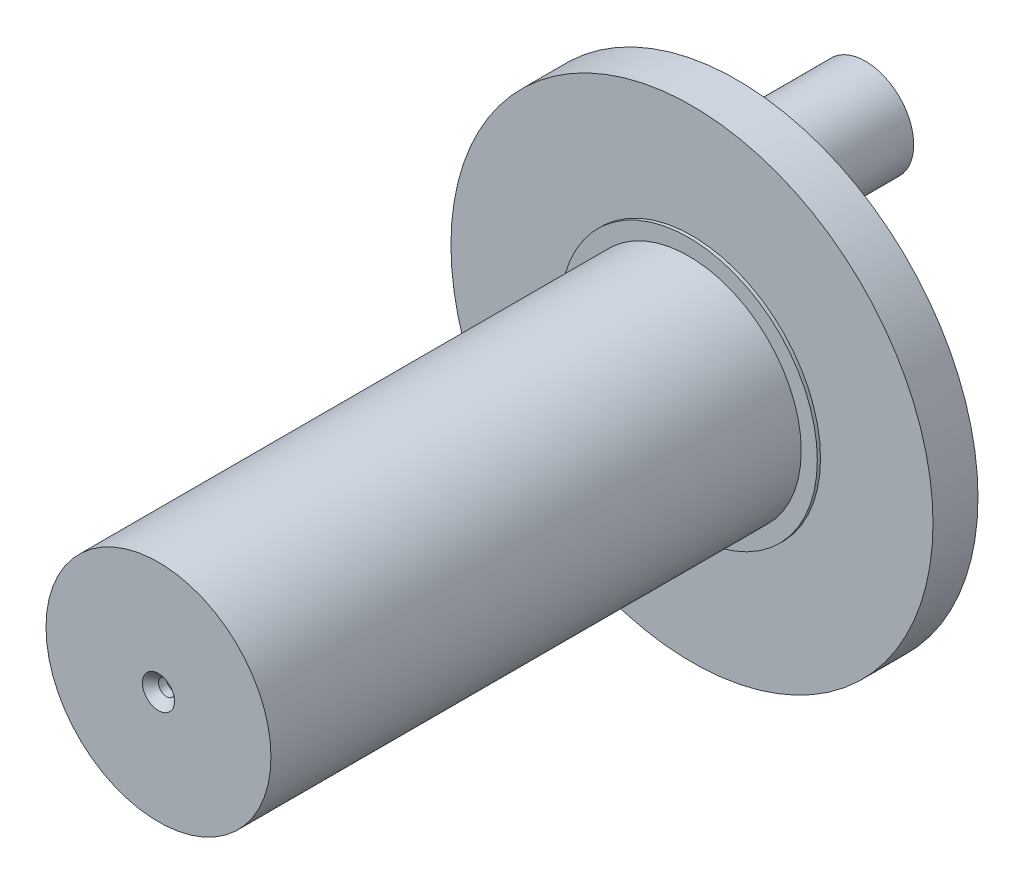
ISO-10303-21;
HEADER;
FILE_DESCRIPTION(('STEP AP214'),'2;1');
FILE_NAME('part.step','',(''),(''),'','','');
FILE_SCHEMA(('AUTOMOTIVE_DESIGN { 1 0 10303 214 1 1 1 1 }'));
ENDSEC;
DATA;
#1=APPLICATION_CONTEXT('core data for automotive mechanical design processes');
#2=APPLICATION_PROTOCOL_DEFINITION('international standard','automotive_design',2000,#1);
#3=PRODUCT_CONTEXT('',#1,'mechanical');
#4=PRODUCT('Part','Part','',(#3));
#5=PRODUCT_RELATED_PRODUCT_CATEGORY('part','',(#4));
#6=PRODUCT_DEFINITION_FORMATION('','',#4);
#7=PRODUCT_DEFINITION_CONTEXT('part definition',#1,'design');
#8=PRODUCT_DEFINITION('design','',#6,#7);
#9=PRODUCT_DEFINITION_SHAPE('','',#8);
#10=(LENGTH_UNIT() NAMED_UNIT(*) SI_UNIT(.MILLI.,.METRE.));
#11=(NAMED_UNIT(*) PLANE_ANGLE_UNIT() SI_UNIT($,.RADIAN.));
#12=(NAMED_UNIT(*) SI_UNIT($,.STERADIAN.) SOLID_ANGLE_UNIT());
#13=UNCERTAINTY_MEASURE_WITH_UNIT(LENGTH_MEASURE(1.E-05),#10,'distance_accuracy_value','');
#14=(GEOMETRIC_REPRESENTATION_CONTEXT(3) GLOBAL_UNCERTAINTY_ASSIGNED_CONTEXT((#13)) GLOBAL_UNIT_ASSIGNED_CONTEXT((#10,
#11,#12)) REPRESENTATION_CONTEXT('',''));
#15=CARTESIAN_POINT('',(0.,0.,0.));
#16=DIRECTION('',(0.,0.,1.));
#17=DIRECTION('',(1.,0.,0.));
#18=AXIS2_PLACEMENT_3D('',#15,#16,#17);
#19=CARTESIAN_POINT('',(0.,9.,-0.4));
#20=DIRECTION('',(0.,0.,-1.));
#21=DIRECTION('',(-1.,0.,0.));
#22=AXIS2_PLACEMENT_3D('',#19,#20,#21);
#23=PLANE('',#22);
#24=CARTESIAN_POINT('',(0.,9.,-0.4));
#25=DIRECTION('',(0.,0.,-1.));
#26=DIRECTION('',(-1.,0.,0.));
#27=AXIS2_PLACEMENT_3D('',#24,#25,#26);
#28=CIRCLE('',#27,5.);
#29=CARTESIAN_POINT('',(-5.,9.,-0.4));
#30=VERTEX_POINT('',#29);
#31=EDGE_CURVE('E64',#30,#30,#28,.T.);
#32=ORIENTED_EDGE('',*,*,#31,.T.);
#33=EDGE_LOOP('',(#32));
#34=FACE_BOUND('',#33,.T.);
#35=CARTESIAN_POINT('',(0.,9.,-0.4));
#36=DIRECTION('',(0.,0.,-1.));
#37=DIRECTION('',(-1.,0.,0.));
#38=AXIS2_PLACEMENT_3D('',#35,#36,#37);
#39=CIRCLE('',#38,3.);
#40=CARTESIAN_POINT('',(-3.,9.,-0.4));
#41=VERTEX_POINT('',#40);
#42=EDGE_CURVE('E37',#41,#41,#39,.F.);
#43=ORIENTED_EDGE('',*,*,#42,.T.);
#44=EDGE_LOOP('',(#43));
#45=FACE_BOUND('',#44,.T.);
#46=ADVANCED_FACE('F33',(#34,#45),#23,.T.);
#47=CARTESIAN_POINT('',(0.,0.,0.));
#48=DIRECTION('',(0.,0.,1.));
#49=DIRECTION('',(1.,0.,0.));
#50=AXIS2_PLACEMENT_3D('',#47,#48,#49);
#51=PLANE('',#50);
#52=CARTESIAN_POINT('',(0.,0.,0.));
#53=DIRECTION('',(0.,0.,1.));
#54=DIRECTION('',(1.,0.,0.));
#55=AXIS2_PLACEMENT_3D('',#52,#53,#54);
#56=CIRCLE('',#55,15.);
#57=CARTESIAN_POINT('',(15.,0.,0.));
#58=VERTEX_POINT('',#57);
#59=EDGE_CURVE('E77',#58,#58,#56,.T.);
#60=ORIENTED_EDGE('',*,*,#59,.F.);
#61=EDGE_LOOP('',(#60));
#62=FACE_BOUND('',#61,.T.);
#63=CARTESIAN_POINT('',(0.,9.,0.));
#64=DIRECTION('',(0.,0.,1.));
#65=DIRECTION('',(1.,0.,0.));
#66=AXIS2_PLACEMENT_3D('',#63,#64,#65);
#67=CIRCLE('',#66,5.);
#68=CARTESIAN_POINT('',(5.,9.,0.));
#69=VERTEX_POINT('',#68);
#70=EDGE_CURVE('E11',#69,#69,#67,.F.);
#71=ORIENTED_EDGE('',*,*,#70,.F.);
#72=EDGE_LOOP('',(#71));
#73=FACE_BOUND('',#72,.T.);
#74=ADVANCED_FACE('F86',(#62,#73),#51,.F.);
#75=CARTESIAN_POINT('',(0.,0.,3.));
#76=DIRECTION('',(0.,0.,1.));
#77=DIRECTION('',(1.,0.,0.));
#78=AXIS2_PLACEMENT_3D('',#75,#76,#77);
#79=PLANE('',#78);
#80=CARTESIAN_POINT('',(0.,0.,3.));
#81=DIRECTION('',(0.,0.,1.));
#82=DIRECTION('',(1.,0.,0.));
#83=AXIS2_PLACEMENT_3D('',#80,#81,#82);
#84=CIRCLE('',#83,8.);
#85=CARTESIAN_POINT('',(8.,0.,3.));
#86=VERTEX_POINT('',#85);
#87=EDGE_CURVE('E74',#86,#86,#84,.T.);
#88=ORIENTED_EDGE('',*,*,#87,.T.);
#89=EDGE_LOOP('',(#88));
#90=FACE_BOUND('',#89,.T.);
#91=CARTESIAN_POINT('',(0.,0.,3.));
#92=DIRECTION('',(0.,0.,1.));
#93=DIRECTION('',(1.,0.,0.));
#94=AXIS2_PLACEMENT_3D('',#91,#92,#93);
#95=CIRCLE('',#94,7.);
#96=CARTESIAN_POINT('',(7.,0.,3.));
#97=VERTEX_POINT('',#96);
#98=EDGE_CURVE('E67',#97,#97,#95,.T.);
#99=ORIENTED_EDGE('',*,*,#98,.F.);
#100=EDGE_LOOP('',(#99));
#101=FACE_BOUND('',#100,.T.);
#102=ADVANCED_FACE('F89',(#90,#101),#79,.T.);
#103=CARTESIAN_POINT('',(0.,0.,2.8));
#104=DIRECTION('',(0.,0.,1.));
#105=DIRECTION('',(1.,0.,0.));
#106=AXIS2_PLACEMENT_3D('',#103,#104,#105);
#107=PLANE('',#106);
#108=CARTESIAN_POINT('',(0.,0.,2.8));
#109=DIRECTION('',(0.,0.,1.));
#110=DIRECTION('',(1.,0.,0.));
#111=AXIS2_PLACEMENT_3D('',#108,#109,#110);
#112=CIRCLE('',#111,15.);
#113=CARTESIAN_POINT('',(15.,0.,2.8));
#114=VERTEX_POINT('',#113);
#115=EDGE_CURVE('E41',#114,#114,#112,.T.);
#116=ORIENTED_EDGE('',*,*,#115,.T.);
#117=EDGE_LOOP('',(#116));
#118=FACE_BOUND('',#117,.T.);
#119=CARTESIAN_POINT('',(0.,0.,2.8));
#120=DIRECTION('',(0.,0.,1.));
#121=DIRECTION('',(1.,0.,0.));
#122=AXIS2_PLACEMENT_3D('',#119,#120,#121);
#123=CIRCLE('',#122,8.);
#124=CARTESIAN_POINT('',(8.,0.,2.8));
#125=VERTEX_POINT('',#124);
#126=EDGE_CURVE('E71',#125,#125,#123,.T.);
#127=ORIENTED_EDGE('',*,*,#126,.F.);
#128=EDGE_LOOP('',(#127));
#129=FACE_BOUND('',#128,.T.);
#130=ADVANCED_FACE('F139',(#118,#129),#107,.T.);
#131=CARTESIAN_POINT('',(0.,0.,2.8));
#132=DIRECTION('',(0.,0.,-1.));
#133=DIRECTION('',(-1.,0.,0.));
#134=AXIS2_PLACEMENT_3D('',#131,#132,#133);
#135=CYLINDRICAL_SURFACE('',#134,15.);
#136=ORIENTED_EDGE('',*,*,#115,.F.);
#137=EDGE_LOOP('',(#136));
#138=FACE_BOUND('',#137,.T.);
#139=ORIENTED_EDGE('',*,*,#59,.T.);
#140=EDGE_LOOP('',(#139));
#141=FACE_BOUND('',#140,.T.);
#142=ADVANCED_FACE('F35',(#138,#141),#135,.T.);
#143=CARTESIAN_POINT('',(0.,0.,3.));
#144=DIRECTION('',(0.,0.,-1.));
#145=DIRECTION('',(-1.,0.,0.));
#146=AXIS2_PLACEMENT_3D('',#143,#144,#145);
#147=CYLINDRICAL_SURFACE('',#146,8.);
#148=ORIENTED_EDGE('',*,*,#87,.F.);
#149=EDGE_LOOP('',(#148));
#150=FACE_BOUND('',#149,.T.);
#151=ORIENTED_EDGE('',*,*,#126,.T.);
#152=EDGE_LOOP('',(#151));
#153=FACE_BOUND('',#152,.T.);
#154=ADVANCED_FACE('F134',(#150,#153),#147,.T.);
#155=CARTESIAN_POINT('',(0.,0.,36.));
#156=DIRECTION('',(0.,0.,-1.));
#157=DIRECTION('',(-1.,0.,0.));
#158=AXIS2_PLACEMENT_3D('',#155,#156,#157);
#159=CYLINDRICAL_SURFACE('',#158,7.);
#160=CARTESIAN_POINT('',(0.,0.,36.));
#161=DIRECTION('',(0.,0.,1.));
#162=DIRECTION('',(1.,0.,0.));
#163=AXIS2_PLACEMENT_3D('',#160,#161,#162);
#164=CIRCLE('',#163,7.);
#165=CARTESIAN_POINT('',(7.,0.,36.));
#166=VERTEX_POINT('',#165);
#167=EDGE_CURVE('E68',#166,#166,#164,.T.);
#168=ORIENTED_EDGE('',*,*,#167,.F.);
#169=EDGE_LOOP('',(#168));
#170=FACE_BOUND('',#169,.T.);
#171=ORIENTED_EDGE('',*,*,#98,.T.);
#172=EDGE_LOOP('',(#171));
#173=FACE_BOUND('',#172,.T.);
#174=ADVANCED_FACE('F104',(#170,#173),#159,.T.);
#175=CARTESIAN_POINT('',(0.,0.,36.));
#176=DIRECTION('',(0.,0.,1.));
#177=DIRECTION('',(1.,0.,0.));
#178=AXIS2_PLACEMENT_3D('',#175,#176,#177);
#179=PLANE('',#178);
#180=CARTESIAN_POINT('',(0.,0.,36.));
#181=DIRECTION('',(0.,0.,1.));
#182=DIRECTION('',(1.,0.,0.));
#183=AXIS2_PLACEMENT_3D('',#180,#181,#182);
#184=CIRCLE('',#183,1.);
#185=CARTESIAN_POINT('',(1.,0.,36.));
#186=VERTEX_POINT('',#185);
#187=EDGE_CURVE('E60',#186,#186,#184,.T.);
#188=ORIENTED_EDGE('',*,*,#187,.F.);
#189=EDGE_LOOP('',(#188));
#190=FACE_BOUND('',#189,.T.);
#191=ORIENTED_EDGE('',*,*,#167,.T.);
#192=EDGE_LOOP('',(#191));
#193=FACE_BOUND('',#192,.T.);
#194=ADVANCED_FACE('F95',(#190,#193),#179,.T.);
#195=CARTESIAN_POINT('',(0.,9.,-0.4));
#196=DIRECTION('',(0.,0.,1.));
#197=DIRECTION('',(1.,0.,0.));
#198=AXIS2_PLACEMENT_3D('',#195,#196,#197);
#199=CYLINDRICAL_SURFACE('',#198,5.);
#200=ORIENTED_EDGE('',*,*,#31,.F.);
#201=EDGE_LOOP('',(#200));
#202=FACE_BOUND('',#201,.T.);
#203=ORIENTED_EDGE('',*,*,#70,.T.);
#204=EDGE_LOOP('',(#203));
#205=FACE_BOUND('',#204,.T.);
#206=ADVANCED_FACE('F92',(#202,#205),#199,.T.);
#207=CARTESIAN_POINT('',(0.,9.,-8.));
#208=DIRECTION('',(0.,0.,1.));
#209=DIRECTION('',(1.,0.,0.));
#210=AXIS2_PLACEMENT_3D('',#207,#208,#209);
#211=CYLINDRICAL_SURFACE('',#210,3.);
#212=ORIENTED_EDGE('',*,*,#42,.F.);
#213=EDGE_LOOP('',(#212));
#214=FACE_BOUND('',#213,.T.);
#215=CARTESIAN_POINT('',(0.,9.,-8.));
#216=DIRECTION('',(0.,0.,-1.));
#217=DIRECTION('',(-1.,0.,0.));
#218=AXIS2_PLACEMENT_3D('',#215,#216,#217);
#219=CIRCLE('',#218,3.);
#220=CARTESIAN_POINT('',(-3.,9.,-8.));
#221=VERTEX_POINT('',#220);
#222=EDGE_CURVE('E54',#221,#221,#219,.T.);
#223=ORIENTED_EDGE('',*,*,#222,.F.);
#224=EDGE_LOOP('',(#223));
#225=FACE_BOUND('',#224,.T.);
#226=ADVANCED_FACE('F94',(#214,#225),#211,.T.);
#227=CARTESIAN_POINT('',(0.,9.,-8.));
#228=DIRECTION('',(0.,0.,-1.));
#229=DIRECTION('',(-1.,0.,0.));
#230=AXIS2_PLACEMENT_3D('',#227,#228,#229);
#231=PLANE('',#230);
#232=ORIENTED_EDGE('',*,*,#222,.T.);
#233=EDGE_LOOP('',(#232));
#234=FACE_BOUND('',#233,.T.);
#235=ADVANCED_FACE('F48',(#234),#231,.T.);
#236=CARTESIAN_POINT('',(0.,0.,35.));
#237=DIRECTION('',(0.,0.,1.));
#238=DIRECTION('',(1.,0.,0.));
#239=AXIS2_PLACEMENT_3D('',#236,#237,#238);
#240=CONICAL_SURFACE('',#239,0.5,1.02974425867665);
#241=CARTESIAN_POINT('',(0.,0.,34.6995696904862));
#242=VERTEX_POINT('',#241);
#243=VERTEX_LOOP('',#242);
#244=FACE_BOUND('',#243,.T.);
#245=CARTESIAN_POINT('',(0.,0.,35.));
#246=DIRECTION('',(0.,0.,1.));
#247=DIRECTION('',(1.,0.,0.));
#248=AXIS2_PLACEMENT_3D('',#245,#246,#247);
#249=CIRCLE('',#248,0.5);
#250=CARTESIAN_POINT('',(0.5,0.,35.));
#251=VERTEX_POINT('',#250);
#252=EDGE_CURVE('E52',#251,#251,#249,.T.);
#253=ORIENTED_EDGE('',*,*,#252,.T.);
#254=EDGE_LOOP('',(#253));
#255=FACE_BOUND('',#254,.T.);
#256=ADVANCED_FACE('F44',(#244,#255),#240,.F.);
#257=CARTESIAN_POINT('',(0.,0.,36.));
#258=DIRECTION('',(0.,0.,1.));
#259=DIRECTION('',(1.,0.,0.));
#260=AXIS2_PLACEMENT_3D('',#257,#258,#259);
#261=CYLINDRICAL_SURFACE('',#260,0.5);
#262=ORIENTED_EDGE('',*,*,#252,.F.);
#263=EDGE_LOOP('',(#262));
#264=FACE_BOUND('',#263,.T.);
#265=CARTESIAN_POINT('',(0.,0.,35.5));
#266=DIRECTION('',(0.,0.,1.));
#267=DIRECTION('',(1.,0.,0.));
#268=AXIS2_PLACEMENT_3D('',#265,#266,#267);
#269=CIRCLE('',#268,0.5);
#270=CARTESIAN_POINT('',(0.5,0.,35.5));
#271=VERTEX_POINT('',#270);
#272=EDGE_CURVE('E55',#271,#271,#269,.T.);
#273=ORIENTED_EDGE('',*,*,#272,.T.);
#274=EDGE_LOOP('',(#273));
#275=FACE_BOUND('',#274,.T.);
#276=ADVANCED_FACE('F47',(#264,#275),#261,.F.);
#277=CARTESIAN_POINT('',(0.,0.,36.));
#278=DIRECTION('',(0.,0.,1.));
#279=DIRECTION('',(1.,0.,0.));
#280=AXIS2_PLACEMENT_3D('',#277,#278,#279);
#281=CONICAL_SURFACE('',#280,1.,0.785398163397448);
#282=ORIENTED_EDGE('',*,*,#272,.F.);
#283=EDGE_LOOP('',(#282));
#284=FACE_BOUND('',#283,.T.);
#285=ORIENTED_EDGE('',*,*,#187,.T.);
#286=EDGE_LOOP('',(#285));
#287=FACE_BOUND('',#286,.T.);
#288=ADVANCED_FACE('F120',(#284,#287),#281,.F.);
#289=CLOSED_SHELL('',(#46,#74,#102,#130,#142,#154,#174,#194,#206,#226,#235,#256,#276,#288));
#290=MANIFOLD_SOLID_BREP('B2',#289);
#291=ADVANCED_BREP_SHAPE_REPRESENTATION('',(#18,#290),#14);
#292=SHAPE_DEFINITION_REPRESENTATION(#9,#291);
ENDSEC;
END-ISO-10303-21;
